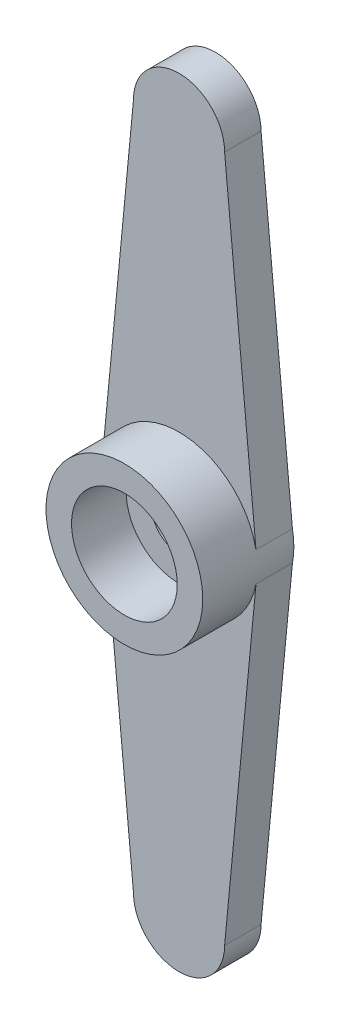
ISO-10303-21;
HEADER;
FILE_DESCRIPTION(('STEP AP214'),'2;1');
FILE_NAME('part.step','',(''),(''),'','','');
FILE_SCHEMA(('AUTOMOTIVE_DESIGN { 1 0 10303 214 1 1 1 1 }'));
ENDSEC;
DATA;
#1=APPLICATION_CONTEXT('core data for automotive mechanical design processes');
#2=APPLICATION_PROTOCOL_DEFINITION('international standard','automotive_design',2000,#1);
#3=PRODUCT_CONTEXT('',#1,'mechanical');
#4=PRODUCT('Part','Part','',(#3));
#5=PRODUCT_RELATED_PRODUCT_CATEGORY('part','',(#4));
#6=PRODUCT_DEFINITION_FORMATION('','',#4);
#7=PRODUCT_DEFINITION_CONTEXT('part definition',#1,'design');
#8=PRODUCT_DEFINITION('design','',#6,#7);
#9=PRODUCT_DEFINITION_SHAPE('','',#8);
#10=(LENGTH_UNIT() NAMED_UNIT(*) SI_UNIT(.MILLI.,.METRE.));
#11=(NAMED_UNIT(*) PLANE_ANGLE_UNIT() SI_UNIT($,.RADIAN.));
#12=(NAMED_UNIT(*) SI_UNIT($,.STERADIAN.) SOLID_ANGLE_UNIT());
#13=UNCERTAINTY_MEASURE_WITH_UNIT(LENGTH_MEASURE(1.E-05),#10,'distance_accuracy_value','');
#14=(GEOMETRIC_REPRESENTATION_CONTEXT(3) GLOBAL_UNCERTAINTY_ASSIGNED_CONTEXT((#13)) GLOBAL_UNIT_ASSIGNED_CONTEXT((#10,
#11,#12)) REPRESENTATION_CONTEXT('',''));
#15=CARTESIAN_POINT('',(0.,0.,0.));
#16=DIRECTION('',(0.,0.,1.));
#17=DIRECTION('',(1.,0.,0.));
#18=AXIS2_PLACEMENT_3D('',#15,#16,#17);
#19=CARTESIAN_POINT('',(0.,0.,2.));
#20=DIRECTION('',(0.,0.,1.));
#21=DIRECTION('',(1.,0.,0.));
#22=AXIS2_PLACEMENT_3D('',#19,#20,#21);
#23=PLANE('',#22);
#24=CARTESIAN_POINT('',(0.,0.,2.));
#25=DIRECTION('',(0.,0.,1.));
#26=DIRECTION('',(1.,0.,0.));
#27=AXIS2_PLACEMENT_3D('',#24,#25,#26);
#28=CIRCLE('',#27,4.3);
#29=CARTESIAN_POINT('',(4.22228969844867,0.813799546801466,2.));
#30=VERTEX_POINT('',#29);
#31=CARTESIAN_POINT('',(-4.22228969844867,0.813799546801466,2.));
#32=VERTEX_POINT('',#31);
#33=EDGE_CURVE('E49',#30,#32,#28,.T.);
#34=ORIENTED_EDGE('',*,*,#33,.F.);
#35=DIRECTION('',(-0.0950583061901296,0.99547170649108,0.));
#36=VECTOR('',#35,1.);
#37=CARTESIAN_POINT('',(2.5,18.85,2.));
#38=LINE('',#37,#36);
#39=CARTESIAN_POINT('',(2.5,18.85,2.));
#40=VERTEX_POINT('',#39);
#41=EDGE_CURVE('E102',#30,#40,#38,.T.);
#42=ORIENTED_EDGE('',*,*,#41,.T.);
#43=CARTESIAN_POINT('',(0.,18.85,2.));
#44=DIRECTION('',(0.,0.,1.));
#45=DIRECTION('',(1.,0.,0.));
#46=AXIS2_PLACEMENT_3D('',#43,#44,#45);
#47=CIRCLE('',#46,2.5);
#48=CARTESIAN_POINT('',(-2.5,18.85,2.));
#49=VERTEX_POINT('',#48);
#50=EDGE_CURVE('E182',#40,#49,#47,.T.);
#51=ORIENTED_EDGE('',*,*,#50,.T.);
#52=DIRECTION('',(-0.0950583061901296,-0.99547170649108,0.));
#53=VECTOR('',#52,1.);
#54=CARTESIAN_POINT('',(-2.5,18.85,2.));
#55=LINE('',#54,#53);
#56=EDGE_CURVE('E121',#49,#32,#55,.T.);
#57=ORIENTED_EDGE('',*,*,#56,.T.);
#58=EDGE_LOOP('',(#34,#42,#51,#57));
#59=FACE_BOUND('',#58,.T.);
#60=ADVANCED_FACE('F38',(#59),#23,.T.);
#61=CARTESIAN_POINT('',(2.5,18.85,2.));
#62=DIRECTION('',(-0.99547170649108,-0.0950583061901296,0.));
#63=DIRECTION('',(0.0950583061901297,-0.99547170649108,0.));
#64=AXIS2_PLACEMENT_3D('',#61,#62,#63);
#65=PLANE('',#64);
#66=DIRECTION('',(-0.0950583061901296,0.99547170649108,0.));
#67=VECTOR('',#66,1.);
#68=CARTESIAN_POINT('',(2.5,18.85,0.));
#69=LINE('',#68,#67);
#70=CARTESIAN_POINT('',(4.22228969844867,0.813799546801466,0.));
#71=VERTEX_POINT('',#70);
#72=CARTESIAN_POINT('',(2.5,18.85,0.));
#73=VERTEX_POINT('',#72);
#74=EDGE_CURVE('E139',#71,#73,#69,.T.);
#75=ORIENTED_EDGE('',*,*,#74,.T.);
#76=DIRECTION('',(0.,0.,-1.));
#77=VECTOR('',#76,1.);
#78=CARTESIAN_POINT('',(2.5,18.85,2.));
#79=LINE('',#78,#77);
#80=EDGE_CURVE('E159',#40,#73,#79,.T.);
#81=ORIENTED_EDGE('',*,*,#80,.F.);
#82=ORIENTED_EDGE('',*,*,#41,.F.);
#83=DIRECTION('',(0.,0.,-1.));
#84=VECTOR('',#83,1.);
#85=CARTESIAN_POINT('',(4.22228969844867,0.813799546801466,2.));
#86=LINE('',#85,#84);
#87=EDGE_CURVE('E42',#30,#71,#86,.T.);
#88=ORIENTED_EDGE('',*,*,#87,.T.);
#89=EDGE_LOOP('',(#75,#81,#82,#88));
#90=FACE_BOUND('',#89,.T.);
#91=ADVANCED_FACE('F40',(#90),#65,.F.);
#92=CARTESIAN_POINT('',(0.,18.85,2.));
#93=DIRECTION('',(0.,0.,-1.));
#94=DIRECTION('',(-1.,0.,0.));
#95=AXIS2_PLACEMENT_3D('',#92,#93,#94);
#96=CYLINDRICAL_SURFACE('',#95,2.5);
#97=CARTESIAN_POINT('',(0.,18.85,0.));
#98=DIRECTION('',(0.,0.,1.));
#99=DIRECTION('',(1.,0.,0.));
#100=AXIS2_PLACEMENT_3D('',#97,#98,#99);
#101=CIRCLE('',#100,2.5);
#102=CARTESIAN_POINT('',(-2.5,18.85,0.));
#103=VERTEX_POINT('',#102);
#104=EDGE_CURVE('E142',#73,#103,#101,.T.);
#105=ORIENTED_EDGE('',*,*,#104,.T.);
#106=DIRECTION('',(0.,0.,-1.));
#107=VECTOR('',#106,1.);
#108=CARTESIAN_POINT('',(-2.5,18.85,2.));
#109=LINE('',#108,#107);
#110=EDGE_CURVE('E157',#49,#103,#109,.T.);
#111=ORIENTED_EDGE('',*,*,#110,.F.);
#112=ORIENTED_EDGE('',*,*,#50,.F.);
#113=ORIENTED_EDGE('',*,*,#80,.T.);
#114=EDGE_LOOP('',(#105,#111,#112,#113));
#115=FACE_BOUND('',#114,.T.);
#116=ADVANCED_FACE('F177',(#115),#96,.T.);
#117=CARTESIAN_POINT('',(-2.5,18.85,2.));
#118=DIRECTION('',(0.99547170649108,-0.0950583061901296,0.));
#119=DIRECTION('',(0.0950583061901297,0.99547170649108,0.));
#120=AXIS2_PLACEMENT_3D('',#117,#118,#119);
#121=PLANE('',#120);
#122=DIRECTION('',(-0.0950583061901296,-0.99547170649108,0.));
#123=VECTOR('',#122,1.);
#124=CARTESIAN_POINT('',(-2.5,18.85,0.));
#125=LINE('',#124,#123);
#126=CARTESIAN_POINT('',(-4.22228969844867,0.813799546801466,0.));
#127=VERTEX_POINT('',#126);
#128=EDGE_CURVE('E144',#103,#127,#125,.T.);
#129=ORIENTED_EDGE('',*,*,#128,.T.);
#130=DIRECTION('',(0.,0.,-1.));
#131=VECTOR('',#130,1.);
#132=CARTESIAN_POINT('',(-4.22228969844867,0.813799546801466,2.));
#133=LINE('',#132,#131);
#134=EDGE_CURVE('E154',#32,#127,#133,.T.);
#135=ORIENTED_EDGE('',*,*,#134,.F.);
#136=ORIENTED_EDGE('',*,*,#56,.F.);
#137=ORIENTED_EDGE('',*,*,#110,.T.);
#138=EDGE_LOOP('',(#129,#135,#136,#137));
#139=FACE_BOUND('',#138,.T.);
#140=ADVANCED_FACE('F180',(#139),#121,.F.);
#141=CARTESIAN_POINT('',(0.,0.,2.));
#142=DIRECTION('',(0.,0.,-1.));
#143=DIRECTION('',(-1.,0.,0.));
#144=AXIS2_PLACEMENT_3D('',#141,#142,#143);
#145=CYLINDRICAL_SURFACE('',#144,4.3);
#146=CARTESIAN_POINT('',(0.,0.,0.));
#147=DIRECTION('',(0.,0.,1.));
#148=DIRECTION('',(1.,0.,0.));
#149=AXIS2_PLACEMENT_3D('',#146,#147,#148);
#150=CIRCLE('',#149,4.3);
#151=CARTESIAN_POINT('',(-4.22228969844867,-0.813799546801466,0.));
#152=VERTEX_POINT('',#151);
#153=EDGE_CURVE('E146',#127,#152,#150,.T.);
#154=ORIENTED_EDGE('',*,*,#153,.T.);
#155=DIRECTION('',(0.,0.,-1.));
#156=VECTOR('',#155,1.);
#157=CARTESIAN_POINT('',(-4.22228969844867,-0.813799546801466,2.));
#158=LINE('',#157,#156);
#159=CARTESIAN_POINT('',(-4.22228969844867,-0.813799546801466,2.));
#160=VERTEX_POINT('',#159);
#161=EDGE_CURVE('E127',#160,#152,#158,.T.);
#162=ORIENTED_EDGE('',*,*,#161,.F.);
#163=CARTESIAN_POINT('',(4.22228969844867,-0.813799546801467,2.));
#164=VERTEX_POINT('',#163);
#165=EDGE_CURVE('E11',#160,#164,#28,.T.);
#166=ORIENTED_EDGE('',*,*,#165,.T.);
#167=DIRECTION('',(0.,0.,-1.));
#168=VECTOR('',#167,1.);
#169=CARTESIAN_POINT('',(4.22228969844867,-0.813799546801467,2.));
#170=LINE('',#169,#168);
#171=CARTESIAN_POINT('',(4.22228969844867,-0.813799546801467,0.));
#172=VERTEX_POINT('',#171);
#173=EDGE_CURVE('E132',#164,#172,#170,.T.);
#174=ORIENTED_EDGE('',*,*,#173,.T.);
#175=CARTESIAN_POINT('',(0.,0.,0.));
#176=DIRECTION('',(0.,0.,1.));
#177=DIRECTION('',(1.,0.,0.));
#178=AXIS2_PLACEMENT_3D('',#175,#176,#177);
#179=CIRCLE('',#178,4.3);
#180=EDGE_CURVE('E136',#172,#71,#179,.T.);
#181=ORIENTED_EDGE('',*,*,#180,.T.);
#182=ORIENTED_EDGE('',*,*,#87,.F.);
#183=ORIENTED_EDGE('',*,*,#33,.T.);
#184=ORIENTED_EDGE('',*,*,#134,.T.);
#185=EDGE_LOOP('',(#154,#162,#166,#174,#181,#182,#183,#184));
#186=FACE_BOUND('',#185,.T.);
#187=CARTESIAN_POINT('',(0.,0.,5.));
#188=DIRECTION('',(0.,0.,1.));
#189=DIRECTION('',(1.,0.,0.));
#190=AXIS2_PLACEMENT_3D('',#187,#188,#189);
#191=CIRCLE('',#190,4.3);
#192=CARTESIAN_POINT('',(4.3,0.,5.));
#193=VERTEX_POINT('',#192);
#194=EDGE_CURVE('E140',#193,#193,#191,.T.);
#195=ORIENTED_EDGE('',*,*,#194,.F.);
#196=EDGE_LOOP('',(#195));
#197=FACE_BOUND('',#196,.T.);
#198=ADVANCED_FACE('F170',(#186,#197),#145,.T.);
#199=CARTESIAN_POINT('',(-2.5,-18.85,2.));
#200=DIRECTION('',(0.99547170649108,0.0950583061901296,0.));
#201=DIRECTION('',(-0.0950583061901296,0.99547170649108,0.));
#202=AXIS2_PLACEMENT_3D('',#199,#200,#201);
#203=PLANE('',#202);
#204=DIRECTION('',(0.0950583061901296,-0.99547170649108,0.));
#205=VECTOR('',#204,1.);
#206=CARTESIAN_POINT('',(-2.5,-18.85,0.));
#207=LINE('',#206,#205);
#208=CARTESIAN_POINT('',(-2.5,-18.85,0.));
#209=VERTEX_POINT('',#208);
#210=EDGE_CURVE('E126',#152,#209,#207,.T.);
#211=ORIENTED_EDGE('',*,*,#210,.T.);
#212=DIRECTION('',(0.,0.,-1.));
#213=VECTOR('',#212,1.);
#214=CARTESIAN_POINT('',(-2.5,-18.85,2.));
#215=LINE('',#214,#213);
#216=CARTESIAN_POINT('',(-2.5,-18.85,2.));
#217=VERTEX_POINT('',#216);
#218=EDGE_CURVE('E123',#217,#209,#215,.T.);
#219=ORIENTED_EDGE('',*,*,#218,.F.);
#220=DIRECTION('',(0.0950583061901296,-0.99547170649108,0.));
#221=VECTOR('',#220,1.);
#222=CARTESIAN_POINT('',(-2.5,-18.85,2.));
#223=LINE('',#222,#221);
#224=EDGE_CURVE('E113',#160,#217,#223,.T.);
#225=ORIENTED_EDGE('',*,*,#224,.F.);
#226=ORIENTED_EDGE('',*,*,#161,.T.);
#227=EDGE_LOOP('',(#211,#219,#225,#226));
#228=FACE_BOUND('',#227,.T.);
#229=ADVANCED_FACE('F124',(#228),#203,.F.);
#230=CARTESIAN_POINT('',(0.,-18.85,2.));
#231=DIRECTION('',(0.,0.,-1.));
#232=DIRECTION('',(-1.,0.,0.));
#233=AXIS2_PLACEMENT_3D('',#230,#231,#232);
#234=CYLINDRICAL_SURFACE('',#233,2.5);
#235=CARTESIAN_POINT('',(0.,-18.85,0.));
#236=DIRECTION('',(0.,0.,1.));
#237=DIRECTION('',(-1.,0.,0.));
#238=AXIS2_PLACEMENT_3D('',#235,#236,#237);
#239=CIRCLE('',#238,2.5);
#240=CARTESIAN_POINT('',(2.5,-18.85,0.));
#241=VERTEX_POINT('',#240);
#242=EDGE_CURVE('E87',#209,#241,#239,.T.);
#243=ORIENTED_EDGE('',*,*,#242,.T.);
#244=DIRECTION('',(0.,0.,-1.));
#245=VECTOR('',#244,1.);
#246=CARTESIAN_POINT('',(2.5,-18.85,2.));
#247=LINE('',#246,#245);
#248=CARTESIAN_POINT('',(2.5,-18.85,2.));
#249=VERTEX_POINT('',#248);
#250=EDGE_CURVE('E128',#249,#241,#247,.T.);
#251=ORIENTED_EDGE('',*,*,#250,.F.);
#252=CARTESIAN_POINT('',(0.,-18.85,2.));
#253=DIRECTION('',(0.,0.,1.));
#254=DIRECTION('',(-1.,0.,0.));
#255=AXIS2_PLACEMENT_3D('',#252,#253,#254);
#256=CIRCLE('',#255,2.5);
#257=EDGE_CURVE('E117',#217,#249,#256,.T.);
#258=ORIENTED_EDGE('',*,*,#257,.F.);
#259=ORIENTED_EDGE('',*,*,#218,.T.);
#260=EDGE_LOOP('',(#243,#251,#258,#259));
#261=FACE_BOUND('',#260,.T.);
#262=ADVANCED_FACE('F130',(#261),#234,.T.);
#263=CARTESIAN_POINT('',(2.5,-18.85,2.));
#264=DIRECTION('',(-0.99547170649108,0.0950583061901298,0.));
#265=DIRECTION('',(-0.0950583061901298,-0.99547170649108,0.));
#266=AXIS2_PLACEMENT_3D('',#263,#264,#265);
#267=PLANE('',#266);
#268=DIRECTION('',(0.0950583061901298,0.99547170649108,0.));
#269=VECTOR('',#268,1.);
#270=CARTESIAN_POINT('',(2.5,-18.85,0.));
#271=LINE('',#270,#269);
#272=EDGE_CURVE('E93',#241,#172,#271,.T.);
#273=ORIENTED_EDGE('',*,*,#272,.T.);
#274=ORIENTED_EDGE('',*,*,#173,.F.);
#275=DIRECTION('',(0.0950583061901298,0.99547170649108,0.));
#276=VECTOR('',#275,1.);
#277=CARTESIAN_POINT('',(2.5,-18.85,2.));
#278=LINE('',#277,#276);
#279=EDGE_CURVE('E57',#249,#164,#278,.T.);
#280=ORIENTED_EDGE('',*,*,#279,.F.);
#281=ORIENTED_EDGE('',*,*,#250,.T.);
#282=EDGE_LOOP('',(#273,#274,#280,#281));
#283=FACE_BOUND('',#282,.T.);
#284=ADVANCED_FACE('F230',(#283),#267,.F.);
#285=ORIENTED_EDGE('',*,*,#165,.F.);
#286=ORIENTED_EDGE('',*,*,#224,.T.);
#287=ORIENTED_EDGE('',*,*,#257,.T.);
#288=ORIENTED_EDGE('',*,*,#279,.T.);
#289=EDGE_LOOP('',(#285,#286,#287,#288));
#290=FACE_BOUND('',#289,.T.);
#291=ADVANCED_FACE('F115',(#290),#23,.T.);
#292=CARTESIAN_POINT('',(0.,0.,0.));
#293=DIRECTION('',(0.,0.,1.));
#294=DIRECTION('',(1.,0.,0.));
#295=AXIS2_PLACEMENT_3D('',#292,#293,#294);
#296=PLANE('',#295);
#297=CARTESIAN_POINT('',(0.,0.,0.));
#298=DIRECTION('',(0.,0.,1.));
#299=DIRECTION('',(1.,0.,0.));
#300=AXIS2_PLACEMENT_3D('',#297,#298,#299);
#301=CIRCLE('',#300,1.5);
#302=CARTESIAN_POINT('',(1.5,0.,0.));
#303=VERTEX_POINT('',#302);
#304=EDGE_CURVE('E192',#303,#303,#301,.T.);
#305=ORIENTED_EDGE('',*,*,#304,.T.);
#306=EDGE_LOOP('',(#305));
#307=FACE_BOUND('',#306,.T.);
#308=ORIENTED_EDGE('',*,*,#180,.F.);
#309=ORIENTED_EDGE('',*,*,#272,.F.);
#310=ORIENTED_EDGE('',*,*,#242,.F.);
#311=ORIENTED_EDGE('',*,*,#210,.F.);
#312=ORIENTED_EDGE('',*,*,#153,.F.);
#313=ORIENTED_EDGE('',*,*,#128,.F.);
#314=ORIENTED_EDGE('',*,*,#104,.F.);
#315=ORIENTED_EDGE('',*,*,#74,.F.);
#316=EDGE_LOOP('',(#308,#309,#310,#311,#312,#313,#314,#315));
#317=FACE_BOUND('',#316,.T.);
#318=ADVANCED_FACE('F173',(#307,#317),#296,.F.);
#319=CARTESIAN_POINT('',(0.,0.,5.));
#320=DIRECTION('',(0.,0.,1.));
#321=DIRECTION('',(1.,0.,0.));
#322=AXIS2_PLACEMENT_3D('',#319,#320,#321);
#323=PLANE('',#322);
#324=ORIENTED_EDGE('',*,*,#194,.T.);
#325=EDGE_LOOP('',(#324));
#326=FACE_BOUND('',#325,.T.);
#327=CARTESIAN_POINT('',(0.,0.,5.));
#328=DIRECTION('',(0.,0.,1.));
#329=DIRECTION('',(1.,0.,0.));
#330=AXIS2_PLACEMENT_3D('',#327,#328,#329);
#331=CIRCLE('',#330,2.9);
#332=CARTESIAN_POINT('',(2.9,0.,5.));
#333=VERTEX_POINT('',#332);
#334=EDGE_CURVE('E186',#333,#333,#331,.T.);
#335=ORIENTED_EDGE('',*,*,#334,.F.);
#336=EDGE_LOOP('',(#335));
#337=FACE_BOUND('',#336,.T.);
#338=ADVANCED_FACE('F216',(#326,#337),#323,.T.);
#339=CARTESIAN_POINT('',(0.,0.,5.));
#340=DIRECTION('',(0.,0.,-1.));
#341=DIRECTION('',(-1.,0.,0.));
#342=AXIS2_PLACEMENT_3D('',#339,#340,#341);
#343=CYLINDRICAL_SURFACE('',#342,2.9);
#344=ORIENTED_EDGE('',*,*,#334,.T.);
#345=EDGE_LOOP('',(#344));
#346=FACE_BOUND('',#345,.T.);
#347=CARTESIAN_POINT('',(0.,0.,2.));
#348=DIRECTION('',(0.,0.,1.));
#349=DIRECTION('',(1.,0.,0.));
#350=AXIS2_PLACEMENT_3D('',#347,#348,#349);
#351=CIRCLE('',#350,2.9);
#352=CARTESIAN_POINT('',(2.9,0.,2.));
#353=VERTEX_POINT('',#352);
#354=EDGE_CURVE('E189',#353,#353,#351,.T.);
#355=ORIENTED_EDGE('',*,*,#354,.F.);
#356=EDGE_LOOP('',(#355));
#357=FACE_BOUND('',#356,.T.);
#358=ADVANCED_FACE('F211',(#346,#357),#343,.F.);
#359=CARTESIAN_POINT('',(0.,0.,2.));
#360=DIRECTION('',(0.,0.,1.));
#361=DIRECTION('',(1.,0.,0.));
#362=AXIS2_PLACEMENT_3D('',#359,#360,#361);
#363=CIRCLE('',#362,1.5);
#364=CARTESIAN_POINT('',(1.5,0.,2.));
#365=VERTEX_POINT('',#364);
#366=EDGE_CURVE('E195',#365,#365,#363,.T.);
#367=ORIENTED_EDGE('',*,*,#366,.F.);
#368=EDGE_LOOP('',(#367));
#369=FACE_BOUND('',#368,.T.);
#370=ORIENTED_EDGE('',*,*,#354,.T.);
#371=EDGE_LOOP('',(#370));
#372=FACE_BOUND('',#371,.T.);
#373=ADVANCED_FACE('F205',(#369,#372),#23,.T.);
#374=CARTESIAN_POINT('',(0.,0.,0.));
#375=DIRECTION('',(0.,0.,1.));
#376=DIRECTION('',(1.,0.,0.));
#377=AXIS2_PLACEMENT_3D('',#374,#375,#376);
#378=CYLINDRICAL_SURFACE('',#377,1.5);
#379=ORIENTED_EDGE('',*,*,#304,.F.);
#380=EDGE_LOOP('',(#379));
#381=FACE_BOUND('',#380,.T.);
#382=ORIENTED_EDGE('',*,*,#366,.T.);
#383=EDGE_LOOP('',(#382));
#384=FACE_BOUND('',#383,.T.);
#385=ADVANCED_FACE('F202',(#381,#384),#378,.F.);
#386=CLOSED_SHELL('',(#60,#91,#116,#140,#198,#229,#262,#284,#291,#318,#338,#358,#373,#385));
#387=MANIFOLD_SOLID_BREP('B2',#386);
#388=ADVANCED_BREP_SHAPE_REPRESENTATION('',(#18,#387),#14);
#389=SHAPE_DEFINITION_REPRESENTATION(#9,#388);
ENDSEC;
END-ISO-10303-21;
